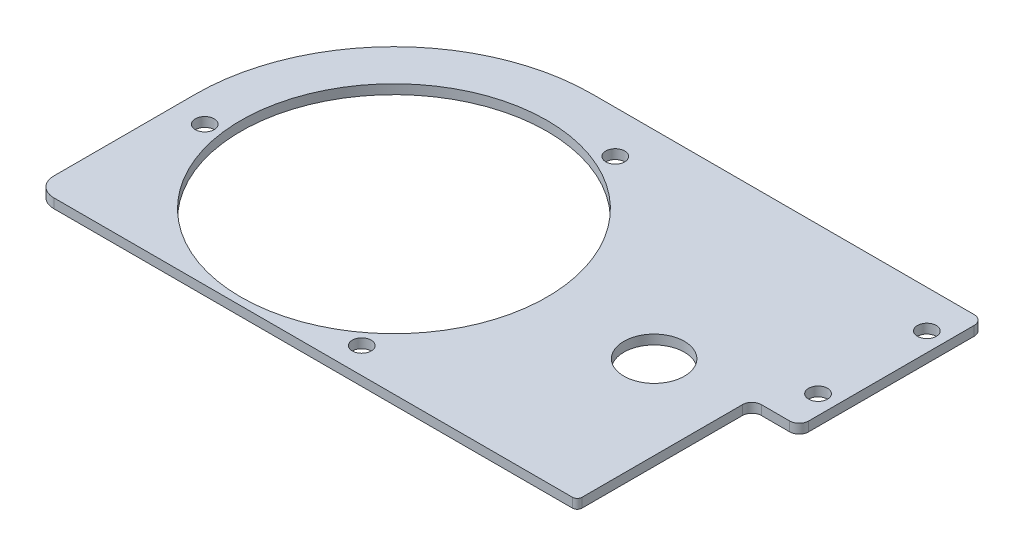
ISO-10303-21;
HEADER;
FILE_DESCRIPTION(('STEP AP214'),'2;1');
FILE_NAME('part.step','',(''),(''),'','','');
FILE_SCHEMA(('AUTOMOTIVE_DESIGN { 1 0 10303 214 1 1 1 1 }'));
ENDSEC;
DATA;
#1=APPLICATION_CONTEXT('core data for automotive mechanical design processes');
#2=APPLICATION_PROTOCOL_DEFINITION('international standard','automotive_design',2000,#1);
#3=PRODUCT_CONTEXT('',#1,'mechanical');
#4=PRODUCT('Part','Part','',(#3));
#5=PRODUCT_RELATED_PRODUCT_CATEGORY('part','',(#4));
#6=PRODUCT_DEFINITION_FORMATION('','',#4);
#7=PRODUCT_DEFINITION_CONTEXT('part definition',#1,'design');
#8=PRODUCT_DEFINITION('design','',#6,#7);
#9=PRODUCT_DEFINITION_SHAPE('','',#8);
#10=(LENGTH_UNIT() NAMED_UNIT(*) SI_UNIT(.MILLI.,.METRE.));
#11=(NAMED_UNIT(*) PLANE_ANGLE_UNIT() SI_UNIT($,.RADIAN.));
#12=(NAMED_UNIT(*) SI_UNIT($,.STERADIAN.) SOLID_ANGLE_UNIT());
#13=UNCERTAINTY_MEASURE_WITH_UNIT(LENGTH_MEASURE(1.E-05),#10,'distance_accuracy_value','');
#14=(GEOMETRIC_REPRESENTATION_CONTEXT(3) GLOBAL_UNCERTAINTY_ASSIGNED_CONTEXT((#13)) GLOBAL_UNIT_ASSIGNED_CONTEXT((#10,
#11,#12)) REPRESENTATION_CONTEXT('',''));
#15=CARTESIAN_POINT('',(0.,0.,0.));
#16=DIRECTION('',(0.,0.,1.));
#17=DIRECTION('',(1.,0.,0.));
#18=AXIS2_PLACEMENT_3D('',#15,#16,#17);
#19=CARTESIAN_POINT('',(-120.668920929197,6.35,95.2310790708027));
#20=DIRECTION('',(0.,-1.,0.));
#21=DIRECTION('',(0.,0.,-1.));
#22=AXIS2_PLACEMENT_3D('',#19,#20,#21);
#23=PLANE('',#22);
#24=CARTESIAN_POINT('',(-120.668920929197,6.35,95.2310790708027));
#25=DIRECTION('',(0.,1.,0.));
#26=DIRECTION('',(0.,0.,-1.));
#27=AXIS2_PLACEMENT_3D('',#24,#25,#26);
#28=CIRCLE('',#27,12.7);
#29=CARTESIAN_POINT('',(-133.368920929197,6.35,95.2310790708027));
#30=VERTEX_POINT('',#29);
#31=CARTESIAN_POINT('',(-120.668920929197,6.35,107.931079070803));
#32=VERTEX_POINT('',#31);
#33=EDGE_CURVE('E179',#30,#32,#28,.T.);
#34=ORIENTED_EDGE('',*,*,#33,.T.);
#35=DIRECTION('',(1.,0.,0.));
#36=VECTOR('',#35,1.);
#37=CARTESIAN_POINT('',(227.955539535401,6.35,107.931079070803));
#38=LINE('',#37,#36);
#39=CARTESIAN_POINT('',(227.955539535401,6.35,107.931079070803));
#40=VERTEX_POINT('',#39);
#41=EDGE_CURVE('E107',#32,#40,#38,.T.);
#42=ORIENTED_EDGE('',*,*,#41,.T.);
#43=CARTESIAN_POINT('',(227.955539535401,6.35,104.765539535401));
#44=DIRECTION('',(0.,1.,0.));
#45=DIRECTION('',(0.,0.,1.));
#46=AXIS2_PLACEMENT_3D('',#43,#44,#45);
#47=CIRCLE('',#46,3.16553953540139);
#48=CARTESIAN_POINT('',(231.121079070803,6.35,104.765539535401));
#49=VERTEX_POINT('',#48);
#50=EDGE_CURVE('E206',#40,#49,#47,.T.);
#51=ORIENTED_EDGE('',*,*,#50,.T.);
#52=DIRECTION('',(0.,0.,-1.));
#53=VECTOR('',#52,1.);
#54=CARTESIAN_POINT('',(231.121079070803,6.35,104.765539535401));
#55=LINE('',#54,#53);
#56=CARTESIAN_POINT('',(231.121079070803,6.35,-3.1007771089668));
#57=VERTEX_POINT('',#56);
#58=EDGE_CURVE('E225',#49,#57,#55,.T.);
#59=ORIENTED_EDGE('',*,*,#58,.T.);
#60=CARTESIAN_POINT('',(237.471079070803,6.35,-3.1007771089668));
#61=DIRECTION('',(0.,-1.,0.));
#62=DIRECTION('',(0.,0.,1.));
#63=AXIS2_PLACEMENT_3D('',#60,#61,#62);
#64=CIRCLE('',#63,6.35);
#65=CARTESIAN_POINT('',(237.471079070803,6.35,-9.4507771089668));
#66=VERTEX_POINT('',#65);
#67=EDGE_CURVE('E222',#57,#66,#64,.T.);
#68=ORIENTED_EDGE('',*,*,#67,.T.);
#69=DIRECTION('',(1.,0.,0.));
#70=VECTOR('',#69,1.);
#71=CARTESIAN_POINT('',(237.471079070803,6.35,-9.4507771089668));
#72=LINE('',#71,#70);
#73=CARTESIAN_POINT('',(256.521079070803,6.35,-9.4507771089668));
#74=VERTEX_POINT('',#73);
#75=EDGE_CURVE('E224',#66,#74,#72,.T.);
#76=ORIENTED_EDGE('',*,*,#75,.T.);
#77=CARTESIAN_POINT('',(256.521079070803,6.35,-15.8007771089668));
#78=DIRECTION('',(0.,1.,0.));
#79=DIRECTION('',(0.,0.,-1.));
#80=AXIS2_PLACEMENT_3D('',#77,#78,#79);
#81=CIRCLE('',#80,6.35000000000001);
#82=CARTESIAN_POINT('',(262.871079070803,6.35,-15.8007771089668));
#83=VERTEX_POINT('',#82);
#84=EDGE_CURVE('E227',#74,#83,#81,.T.);
#85=ORIENTED_EDGE('',*,*,#84,.T.);
#86=DIRECTION('',(0.,0.,-1.));
#87=VECTOR('',#86,1.);
#88=CARTESIAN_POINT('',(262.871079070803,6.35,-127.018920929198));
#89=LINE('',#88,#87);
#90=CARTESIAN_POINT('',(262.871079070803,6.35,-127.018920929198));
#91=VERTEX_POINT('',#90);
#92=EDGE_CURVE('E233',#83,#91,#89,.T.);
#93=ORIENTED_EDGE('',*,*,#92,.T.);
#94=CARTESIAN_POINT('',(256.521079070803,6.35,-127.018920929198));
#95=DIRECTION('',(0.,1.,0.));
#96=DIRECTION('',(0.,0.,-1.));
#97=AXIS2_PLACEMENT_3D('',#94,#95,#96);
#98=CIRCLE('',#97,6.34999999999997);
#99=CARTESIAN_POINT('',(256.521079070803,6.35,-133.368920929197));
#100=VERTEX_POINT('',#99);
#101=EDGE_CURVE('E138',#91,#100,#98,.T.);
#102=ORIENTED_EDGE('',*,*,#101,.T.);
#103=DIRECTION('',(-1.,0.,0.));
#104=VECTOR('',#103,1.);
#105=CARTESIAN_POINT('',(256.521079070803,6.35,-133.368920929197));
#106=LINE('',#105,#104);
#107=CARTESIAN_POINT('',(0.,6.35,-133.368920929197));
#108=VERTEX_POINT('',#107);
#109=EDGE_CURVE('E132',#100,#108,#106,.T.);
#110=ORIENTED_EDGE('',*,*,#109,.T.);
#111=CARTESIAN_POINT('',(0.,6.35,0.));
#112=DIRECTION('',(0.,1.,0.));
#113=DIRECTION('',(0.,0.,-1.));
#114=AXIS2_PLACEMENT_3D('',#111,#112,#113);
#115=CIRCLE('',#114,133.368920929197);
#116=CARTESIAN_POINT('',(-133.368920929197,6.35,0.));
#117=VERTEX_POINT('',#116);
#118=EDGE_CURVE('E136',#108,#117,#115,.T.);
#119=ORIENTED_EDGE('',*,*,#118,.T.);
#120=DIRECTION('',(0.,0.,1.));
#121=VECTOR('',#120,1.);
#122=CARTESIAN_POINT('',(-133.368920929197,6.35,0.));
#123=LINE('',#122,#121);
#124=EDGE_CURVE('E52',#117,#30,#123,.T.);
#125=ORIENTED_EDGE('',*,*,#124,.T.);
#126=EDGE_LOOP('',(#34,#42,#51,#59,#68,#76,#85,#93,#102,#110,#119,#125));
#127=FACE_BOUND('',#126,.T.);
#128=CARTESIAN_POINT('',(0.,6.35,0.));
#129=DIRECTION('',(0.,1.,0.));
#130=DIRECTION('',(0.,0.,1.));
#131=AXIS2_PLACEMENT_3D('',#128,#129,#130);
#132=CIRCLE('',#131,102.87);
#133=CARTESIAN_POINT('',(0.,6.35,102.87));
#134=VERTEX_POINT('',#133);
#135=EDGE_CURVE('E160',#134,#134,#132,.T.);
#136=ORIENTED_EDGE('',*,*,#135,.F.);
#137=EDGE_LOOP('',(#136));
#138=FACE_BOUND('',#137,.T.);
#139=CARTESIAN_POINT('',(-112.738641363336,6.35,14.3749635436917));
#140=DIRECTION('',(0.,1.,0.));
#141=DIRECTION('',(0.,0.,1.));
#142=AXIS2_PLACEMENT_3D('',#139,#140,#141);
#143=CIRCLE('',#142,6.34999999998765);
#144=CARTESIAN_POINT('',(-112.738641363336,6.35,20.7249635436794));
#145=VERTEX_POINT('',#144);
#146=EDGE_CURVE('E327',#145,#145,#143,.T.);
#147=ORIENTED_EDGE('',*,*,#146,.F.);
#148=EDGE_LOOP('',(#147));
#149=FACE_BOUND('',#148,.T.);
#150=CARTESIAN_POINT('',(250.171079070803,6.35,-107.968920929197));
#151=DIRECTION('',(0.,1.,0.));
#152=DIRECTION('',(0.,0.,1.));
#153=AXIS2_PLACEMENT_3D('',#150,#151,#152);
#154=CIRCLE('',#153,6.34999999999999);
#155=CARTESIAN_POINT('',(250.171079070803,6.35,-101.618920929198));
#156=VERTEX_POINT('',#155);
#157=EDGE_CURVE('E321',#156,#156,#154,.T.);
#158=ORIENTED_EDGE('',*,*,#157,.F.);
#159=EDGE_LOOP('',(#158));
#160=FACE_BOUND('',#159,.T.);
#161=CARTESIAN_POINT('',(250.171079070803,6.35,-34.8507771089668));
#162=DIRECTION('',(0.,1.,0.));
#163=DIRECTION('',(0.,0.,1.));
#164=AXIS2_PLACEMENT_3D('',#161,#162,#163);
#165=CIRCLE('',#164,6.34999999999993);
#166=CARTESIAN_POINT('',(250.171079070803,6.35,-28.5007771089669));
#167=VERTEX_POINT('',#166);
#168=EDGE_CURVE('E315',#167,#167,#165,.T.);
#169=ORIENTED_EDGE('',*,*,#168,.F.);
#170=EDGE_LOOP('',(#169));
#171=FACE_BOUND('',#170,.T.);
#172=CARTESIAN_POINT('',(43.9202370743556,6.35,-104.822009180638));
#173=DIRECTION('',(0.,1.,0.));
#174=DIRECTION('',(0.,0.,1.));
#175=AXIS2_PLACEMENT_3D('',#172,#173,#174);
#176=CIRCLE('',#175,6.35000000000716);
#177=CARTESIAN_POINT('',(43.9202370743556,6.35,-98.4720091806305));
#178=VERTEX_POINT('',#177);
#179=EDGE_CURVE('E309',#178,#178,#176,.T.);
#180=ORIENTED_EDGE('',*,*,#179,.F.);
#181=EDGE_LOOP('',(#180));
#182=FACE_BOUND('',#181,.T.);
#183=CARTESIAN_POINT('',(68.8184042889801,6.35,90.4470456369459));
#184=DIRECTION('',(0.,1.,0.));
#185=DIRECTION('',(0.,0.,1.));
#186=AXIS2_PLACEMENT_3D('',#183,#184,#185);
#187=CIRCLE('',#186,6.35000000000515);
#188=CARTESIAN_POINT('',(68.8184042889801,6.35,96.7970456369511));
#189=VERTEX_POINT('',#188);
#190=EDGE_CURVE('E302',#189,#189,#187,.T.);
#191=ORIENTED_EDGE('',*,*,#190,.F.);
#192=EDGE_LOOP('',(#191));
#193=FACE_BOUND('',#192,.T.);
#194=CARTESIAN_POINT('',(174.732998702395,6.35,-0.124686488838717));
#195=DIRECTION('',(0.,-1.,0.));
#196=DIRECTION('',(0.,0.,-1.));
#197=AXIS2_PLACEMENT_3D('',#194,#195,#196);
#198=CIRCLE('',#197,20.32);
#199=CARTESIAN_POINT('',(174.732998702395,6.35,-20.4446864888387));
#200=VERTEX_POINT('',#199);
#201=EDGE_CURVE('E297',#200,#200,#198,.F.);
#202=ORIENTED_EDGE('',*,*,#201,.F.);
#203=EDGE_LOOP('',(#202));
#204=FACE_BOUND('',#203,.T.);
#205=ADVANCED_FACE('F35',(#127,#138,#149,#160,#171,#182,#193,#204),#23,.F.);
#206=CARTESIAN_POINT('',(-120.668920929197,0.,95.2310790708027));
#207=DIRECTION('',(0.,-1.,0.));
#208=DIRECTION('',(0.,0.,-1.));
#209=AXIS2_PLACEMENT_3D('',#206,#207,#208);
#210=PLANE('',#209);
#211=CARTESIAN_POINT('',(68.8184042889801,0.,90.4470456369459));
#212=DIRECTION('',(0.,1.,0.));
#213=DIRECTION('',(0.,0.,1.));
#214=AXIS2_PLACEMENT_3D('',#211,#212,#213);
#215=CIRCLE('',#214,6.35000000000515);
#216=CARTESIAN_POINT('',(68.8184042889801,0.,96.7970456369511));
#217=VERTEX_POINT('',#216);
#218=EDGE_CURVE('E299',#217,#217,#215,.T.);
#219=ORIENTED_EDGE('',*,*,#218,.T.);
#220=EDGE_LOOP('',(#219));
#221=FACE_BOUND('',#220,.T.);
#222=CARTESIAN_POINT('',(250.171079070803,0.,-34.8507771089668));
#223=DIRECTION('',(0.,1.,0.));
#224=DIRECTION('',(0.,0.,1.));
#225=AXIS2_PLACEMENT_3D('',#222,#223,#224);
#226=CIRCLE('',#225,6.34999999999993);
#227=CARTESIAN_POINT('',(250.171079070803,0.,-28.5007771089669));
#228=VERTEX_POINT('',#227);
#229=EDGE_CURVE('E312',#228,#228,#226,.T.);
#230=ORIENTED_EDGE('',*,*,#229,.T.);
#231=EDGE_LOOP('',(#230));
#232=FACE_BOUND('',#231,.T.);
#233=CARTESIAN_POINT('',(-112.738641363336,0.,14.3749635436917));
#234=DIRECTION('',(0.,1.,0.));
#235=DIRECTION('',(0.,0.,1.));
#236=AXIS2_PLACEMENT_3D('',#233,#234,#235);
#237=CIRCLE('',#236,6.34999999998765);
#238=CARTESIAN_POINT('',(-112.738641363336,0.,20.7249635436794));
#239=VERTEX_POINT('',#238);
#240=EDGE_CURVE('E324',#239,#239,#237,.T.);
#241=ORIENTED_EDGE('',*,*,#240,.T.);
#242=EDGE_LOOP('',(#241));
#243=FACE_BOUND('',#242,.T.);
#244=CARTESIAN_POINT('',(-120.668920929197,0.,95.2310790708027));
#245=DIRECTION('',(0.,1.,0.));
#246=DIRECTION('',(0.,0.,-1.));
#247=AXIS2_PLACEMENT_3D('',#244,#245,#246);
#248=CIRCLE('',#247,12.7);
#249=CARTESIAN_POINT('',(-133.368920929197,0.,95.2310790708027));
#250=VERTEX_POINT('',#249);
#251=CARTESIAN_POINT('',(-120.668920929197,0.,107.931079070803));
#252=VERTEX_POINT('',#251);
#253=EDGE_CURVE('E156',#250,#252,#248,.T.);
#254=ORIENTED_EDGE('',*,*,#253,.F.);
#255=DIRECTION('',(0.,0.,1.));
#256=VECTOR('',#255,1.);
#257=CARTESIAN_POINT('',(-133.368920929197,0.,0.));
#258=LINE('',#257,#256);
#259=CARTESIAN_POINT('',(-133.368920929197,0.,0.));
#260=VERTEX_POINT('',#259);
#261=EDGE_CURVE('E99',#260,#250,#258,.T.);
#262=ORIENTED_EDGE('',*,*,#261,.F.);
#263=CARTESIAN_POINT('',(0.,0.,0.));
#264=DIRECTION('',(0.,1.,0.));
#265=DIRECTION('',(0.,0.,-1.));
#266=AXIS2_PLACEMENT_3D('',#263,#264,#265);
#267=CIRCLE('',#266,133.368920929197);
#268=CARTESIAN_POINT('',(0.,0.,-133.368920929197));
#269=VERTEX_POINT('',#268);
#270=EDGE_CURVE('E93',#269,#260,#267,.T.);
#271=ORIENTED_EDGE('',*,*,#270,.F.);
#272=DIRECTION('',(-1.,0.,0.));
#273=VECTOR('',#272,1.);
#274=CARTESIAN_POINT('',(256.521079070803,0.,-133.368920929197));
#275=LINE('',#274,#273);
#276=CARTESIAN_POINT('',(256.521079070803,0.,-133.368920929197));
#277=VERTEX_POINT('',#276);
#278=EDGE_CURVE('E146',#277,#269,#275,.T.);
#279=ORIENTED_EDGE('',*,*,#278,.F.);
#280=CARTESIAN_POINT('',(256.521079070803,0.,-127.018920929198));
#281=DIRECTION('',(0.,1.,0.));
#282=DIRECTION('',(0.,0.,-1.));
#283=AXIS2_PLACEMENT_3D('',#280,#281,#282);
#284=CIRCLE('',#283,6.34999999999997);
#285=CARTESIAN_POINT('',(262.871079070803,0.,-127.018920929198));
#286=VERTEX_POINT('',#285);
#287=EDGE_CURVE('E174',#286,#277,#284,.T.);
#288=ORIENTED_EDGE('',*,*,#287,.F.);
#289=DIRECTION('',(0.,0.,-1.));
#290=VECTOR('',#289,1.);
#291=CARTESIAN_POINT('',(262.871079070803,0.,-127.018920929198));
#292=LINE('',#291,#290);
#293=CARTESIAN_POINT('',(262.871079070803,0.,-15.8007771089668));
#294=VERTEX_POINT('',#293);
#295=EDGE_CURVE('E172',#294,#286,#292,.T.);
#296=ORIENTED_EDGE('',*,*,#295,.F.);
#297=CARTESIAN_POINT('',(256.521079070803,0.,-15.8007771089668));
#298=DIRECTION('',(0.,1.,0.));
#299=DIRECTION('',(0.,0.,-1.));
#300=AXIS2_PLACEMENT_3D('',#297,#298,#299);
#301=CIRCLE('',#300,6.35000000000001);
#302=CARTESIAN_POINT('',(256.521079070803,0.,-9.4507771089668));
#303=VERTEX_POINT('',#302);
#304=EDGE_CURVE('E170',#303,#294,#301,.T.);
#305=ORIENTED_EDGE('',*,*,#304,.F.);
#306=DIRECTION('',(1.,0.,0.));
#307=VECTOR('',#306,1.);
#308=CARTESIAN_POINT('',(237.471079070803,0.,-9.4507771089668));
#309=LINE('',#308,#307);
#310=CARTESIAN_POINT('',(237.471079070803,0.,-9.4507771089668));
#311=VERTEX_POINT('',#310);
#312=EDGE_CURVE('E168',#311,#303,#309,.T.);
#313=ORIENTED_EDGE('',*,*,#312,.F.);
#314=CARTESIAN_POINT('',(237.471079070803,0.,-3.1007771089668));
#315=DIRECTION('',(0.,-1.,0.));
#316=DIRECTION('',(0.,0.,1.));
#317=AXIS2_PLACEMENT_3D('',#314,#315,#316);
#318=CIRCLE('',#317,6.35);
#319=CARTESIAN_POINT('',(231.121079070803,0.,-3.1007771089668));
#320=VERTEX_POINT('',#319);
#321=EDGE_CURVE('E166',#320,#311,#318,.T.);
#322=ORIENTED_EDGE('',*,*,#321,.F.);
#323=DIRECTION('',(0.,0.,-1.));
#324=VECTOR('',#323,1.);
#325=CARTESIAN_POINT('',(231.121079070803,0.,104.765539535401));
#326=LINE('',#325,#324);
#327=CARTESIAN_POINT('',(231.121079070803,0.,104.765539535401));
#328=VERTEX_POINT('',#327);
#329=EDGE_CURVE('E164',#328,#320,#326,.T.);
#330=ORIENTED_EDGE('',*,*,#329,.F.);
#331=CARTESIAN_POINT('',(227.955539535401,0.,104.765539535401));
#332=DIRECTION('',(0.,1.,0.));
#333=DIRECTION('',(0.,0.,1.));
#334=AXIS2_PLACEMENT_3D('',#331,#332,#333);
#335=CIRCLE('',#334,3.16553953540139);
#336=CARTESIAN_POINT('',(227.955539535401,0.,107.931079070803));
#337=VERTEX_POINT('',#336);
#338=EDGE_CURVE('E162',#337,#328,#335,.T.);
#339=ORIENTED_EDGE('',*,*,#338,.F.);
#340=DIRECTION('',(1.,0.,0.));
#341=VECTOR('',#340,1.);
#342=CARTESIAN_POINT('',(227.955539535401,0.,107.931079070803));
#343=LINE('',#342,#341);
#344=EDGE_CURVE('E159',#252,#337,#343,.T.);
#345=ORIENTED_EDGE('',*,*,#344,.F.);
#346=EDGE_LOOP('',(#254,#262,#271,#279,#288,#296,#305,#313,#322,#330,#339,#345));
#347=FACE_BOUND('',#346,.T.);
#348=CARTESIAN_POINT('',(0.,0.,0.));
#349=DIRECTION('',(0.,1.,0.));
#350=DIRECTION('',(0.,0.,1.));
#351=AXIS2_PLACEMENT_3D('',#348,#349,#350);
#352=CIRCLE('',#351,102.87);
#353=CARTESIAN_POINT('',(0.,0.,102.87));
#354=VERTEX_POINT('',#353);
#355=EDGE_CURVE('E330',#354,#354,#352,.T.);
#356=ORIENTED_EDGE('',*,*,#355,.T.);
#357=EDGE_LOOP('',(#356));
#358=FACE_BOUND('',#357,.T.);
#359=CARTESIAN_POINT('',(250.171079070803,0.,-107.968920929197));
#360=DIRECTION('',(0.,1.,0.));
#361=DIRECTION('',(0.,0.,1.));
#362=AXIS2_PLACEMENT_3D('',#359,#360,#361);
#363=CIRCLE('',#362,6.34999999999999);
#364=CARTESIAN_POINT('',(250.171079070803,0.,-101.618920929198));
#365=VERTEX_POINT('',#364);
#366=EDGE_CURVE('E318',#365,#365,#363,.T.);
#367=ORIENTED_EDGE('',*,*,#366,.T.);
#368=EDGE_LOOP('',(#367));
#369=FACE_BOUND('',#368,.T.);
#370=CARTESIAN_POINT('',(43.9202370743556,0.,-104.822009180638));
#371=DIRECTION('',(0.,1.,0.));
#372=DIRECTION('',(0.,0.,1.));
#373=AXIS2_PLACEMENT_3D('',#370,#371,#372);
#374=CIRCLE('',#373,6.35000000000716);
#375=CARTESIAN_POINT('',(43.9202370743556,0.,-98.4720091806305));
#376=VERTEX_POINT('',#375);
#377=EDGE_CURVE('E307',#376,#376,#374,.T.);
#378=ORIENTED_EDGE('',*,*,#377,.T.);
#379=EDGE_LOOP('',(#378));
#380=FACE_BOUND('',#379,.T.);
#381=CARTESIAN_POINT('',(174.732998702395,0.,-0.124686488838717));
#382=DIRECTION('',(0.,1.,0.));
#383=DIRECTION('',(0.,0.,1.));
#384=AXIS2_PLACEMENT_3D('',#381,#382,#383);
#385=CIRCLE('',#384,20.32);
#386=CARTESIAN_POINT('',(174.732998702395,0.,20.1953135111613));
#387=VERTEX_POINT('',#386);
#388=EDGE_CURVE('E294',#387,#387,#385,.T.);
#389=ORIENTED_EDGE('',*,*,#388,.T.);
#390=EDGE_LOOP('',(#389));
#391=FACE_BOUND('',#390,.T.);
#392=ADVANCED_FACE('F210',(#221,#232,#243,#347,#358,#369,#380,#391),#210,.T.);
#393=CARTESIAN_POINT('',(-120.668920929197,6.35,95.2310790708027));
#394=DIRECTION('',(0.,-1.,0.));
#395=DIRECTION('',(0.,0.,-1.));
#396=AXIS2_PLACEMENT_3D('',#393,#394,#395);
#397=CYLINDRICAL_SURFACE('',#396,12.7);
#398=ORIENTED_EDGE('',*,*,#253,.T.);
#399=DIRECTION('',(0.,-1.,0.));
#400=VECTOR('',#399,1.);
#401=CARTESIAN_POINT('',(-120.668920929197,6.35,107.931079070803));
#402=LINE('',#401,#400);
#403=EDGE_CURVE('E11',#32,#252,#402,.T.);
#404=ORIENTED_EDGE('',*,*,#403,.F.);
#405=ORIENTED_EDGE('',*,*,#33,.F.);
#406=DIRECTION('',(0.,-1.,0.));
#407=VECTOR('',#406,1.);
#408=CARTESIAN_POINT('',(-133.368920929197,6.35,95.2310790708027));
#409=LINE('',#408,#407);
#410=EDGE_CURVE('E152',#30,#250,#409,.T.);
#411=ORIENTED_EDGE('',*,*,#410,.T.);
#412=EDGE_LOOP('',(#398,#404,#405,#411));
#413=FACE_BOUND('',#412,.T.);
#414=ADVANCED_FACE('F37',(#413),#397,.T.);
#415=CARTESIAN_POINT('',(227.955539535401,6.35,107.931079070803));
#416=DIRECTION('',(0.,0.,-1.));
#417=DIRECTION('',(-1.,0.,0.));
#418=AXIS2_PLACEMENT_3D('',#415,#416,#417);
#419=PLANE('',#418);
#420=ORIENTED_EDGE('',*,*,#344,.T.);
#421=DIRECTION('',(0.,-1.,0.));
#422=VECTOR('',#421,1.);
#423=CARTESIAN_POINT('',(227.955539535401,6.35,107.931079070803));
#424=LINE('',#423,#422);
#425=EDGE_CURVE('E44',#40,#337,#424,.T.);
#426=ORIENTED_EDGE('',*,*,#425,.F.);
#427=ORIENTED_EDGE('',*,*,#41,.F.);
#428=ORIENTED_EDGE('',*,*,#403,.T.);
#429=EDGE_LOOP('',(#420,#426,#427,#428));
#430=FACE_BOUND('',#429,.T.);
#431=ADVANCED_FACE('F471',(#430),#419,.F.);
#432=CARTESIAN_POINT('',(227.955539535401,6.35,104.765539535401));
#433=DIRECTION('',(0.,-1.,0.));
#434=DIRECTION('',(0.,0.,-1.));
#435=AXIS2_PLACEMENT_3D('',#432,#433,#434);
#436=CYLINDRICAL_SURFACE('',#435,3.16553953540139);
#437=ORIENTED_EDGE('',*,*,#338,.T.);
#438=DIRECTION('',(0.,-1.,0.));
#439=VECTOR('',#438,1.);
#440=CARTESIAN_POINT('',(231.121079070803,6.35,104.765539535401));
#441=LINE('',#440,#439);
#442=EDGE_CURVE('E198',#49,#328,#441,.T.);
#443=ORIENTED_EDGE('',*,*,#442,.F.);
#444=ORIENTED_EDGE('',*,*,#50,.F.);
#445=ORIENTED_EDGE('',*,*,#425,.T.);
#446=EDGE_LOOP('',(#437,#443,#444,#445));
#447=FACE_BOUND('',#446,.T.);
#448=ADVANCED_FACE('F204',(#447),#436,.T.);
#449=CARTESIAN_POINT('',(231.121079070803,6.35,104.765539535401));
#450=DIRECTION('',(-1.,0.,0.));
#451=DIRECTION('',(0.,0.,1.));
#452=AXIS2_PLACEMENT_3D('',#449,#450,#451);
#453=PLANE('',#452);
#454=ORIENTED_EDGE('',*,*,#329,.T.);
#455=DIRECTION('',(0.,-1.,0.));
#456=VECTOR('',#455,1.);
#457=CARTESIAN_POINT('',(231.121079070803,6.35,-3.1007771089668));
#458=LINE('',#457,#456);
#459=EDGE_CURVE('E195',#57,#320,#458,.T.);
#460=ORIENTED_EDGE('',*,*,#459,.F.);
#461=ORIENTED_EDGE('',*,*,#58,.F.);
#462=ORIENTED_EDGE('',*,*,#442,.T.);
#463=EDGE_LOOP('',(#454,#460,#461,#462));
#464=FACE_BOUND('',#463,.T.);
#465=ADVANCED_FACE('F216',(#464),#453,.F.);
#466=CARTESIAN_POINT('',(237.471079070803,6.35,-3.1007771089668));
#467=DIRECTION('',(0.,-1.,0.));
#468=DIRECTION('',(0.,0.,-1.));
#469=AXIS2_PLACEMENT_3D('',#466,#467,#468);
#470=CYLINDRICAL_SURFACE('',#469,6.35);
#471=ORIENTED_EDGE('',*,*,#321,.T.);
#472=DIRECTION('',(0.,-1.,0.));
#473=VECTOR('',#472,1.);
#474=CARTESIAN_POINT('',(237.471079070803,6.35,-9.4507771089668));
#475=LINE('',#474,#473);
#476=EDGE_CURVE('E192',#66,#311,#475,.T.);
#477=ORIENTED_EDGE('',*,*,#476,.F.);
#478=ORIENTED_EDGE('',*,*,#67,.F.);
#479=ORIENTED_EDGE('',*,*,#459,.T.);
#480=EDGE_LOOP('',(#471,#477,#478,#479));
#481=FACE_BOUND('',#480,.T.);
#482=ADVANCED_FACE('F220',(#481),#470,.F.);
#483=CARTESIAN_POINT('',(237.471079070803,6.35,-9.4507771089668));
#484=DIRECTION('',(0.,0.,-1.));
#485=DIRECTION('',(-1.,0.,0.));
#486=AXIS2_PLACEMENT_3D('',#483,#484,#485);
#487=PLANE('',#486);
#488=ORIENTED_EDGE('',*,*,#312,.T.);
#489=DIRECTION('',(0.,-1.,0.));
#490=VECTOR('',#489,1.);
#491=CARTESIAN_POINT('',(256.521079070803,6.35,-9.4507771089668));
#492=LINE('',#491,#490);
#493=EDGE_CURVE('E189',#74,#303,#492,.T.);
#494=ORIENTED_EDGE('',*,*,#493,.F.);
#495=ORIENTED_EDGE('',*,*,#75,.F.);
#496=ORIENTED_EDGE('',*,*,#476,.T.);
#497=EDGE_LOOP('',(#488,#494,#495,#496));
#498=FACE_BOUND('',#497,.T.);
#499=ADVANCED_FACE('F436',(#498),#487,.F.);
#500=CARTESIAN_POINT('',(256.521079070803,6.35,-15.8007771089668));
#501=DIRECTION('',(0.,-1.,0.));
#502=DIRECTION('',(0.,0.,-1.));
#503=AXIS2_PLACEMENT_3D('',#500,#501,#502);
#504=CYLINDRICAL_SURFACE('',#503,6.35000000000001);
#505=ORIENTED_EDGE('',*,*,#304,.T.);
#506=DIRECTION('',(0.,-1.,0.));
#507=VECTOR('',#506,1.);
#508=CARTESIAN_POINT('',(262.871079070803,6.35,-15.8007771089668));
#509=LINE('',#508,#507);
#510=EDGE_CURVE('E186',#83,#294,#509,.T.);
#511=ORIENTED_EDGE('',*,*,#510,.F.);
#512=ORIENTED_EDGE('',*,*,#84,.F.);
#513=ORIENTED_EDGE('',*,*,#493,.T.);
#514=EDGE_LOOP('',(#505,#511,#512,#513));
#515=FACE_BOUND('',#514,.T.);
#516=ADVANCED_FACE('F427',(#515),#504,.T.);
#517=CARTESIAN_POINT('',(262.871079070803,6.35,-127.018920929198));
#518=DIRECTION('',(-1.,0.,0.));
#519=DIRECTION('',(0.,0.,1.));
#520=AXIS2_PLACEMENT_3D('',#517,#518,#519);
#521=PLANE('',#520);
#522=ORIENTED_EDGE('',*,*,#295,.T.);
#523=DIRECTION('',(0.,-1.,0.));
#524=VECTOR('',#523,1.);
#525=CARTESIAN_POINT('',(262.871079070803,6.35,-127.018920929198));
#526=LINE('',#525,#524);
#527=EDGE_CURVE('E183',#91,#286,#526,.T.);
#528=ORIENTED_EDGE('',*,*,#527,.F.);
#529=ORIENTED_EDGE('',*,*,#92,.F.);
#530=ORIENTED_EDGE('',*,*,#510,.T.);
#531=EDGE_LOOP('',(#522,#528,#529,#530));
#532=FACE_BOUND('',#531,.T.);
#533=ADVANCED_FACE('F239',(#532),#521,.F.);
#534=CARTESIAN_POINT('',(256.521079070803,6.35,-127.018920929198));
#535=DIRECTION('',(0.,-1.,0.));
#536=DIRECTION('',(0.,0.,-1.));
#537=AXIS2_PLACEMENT_3D('',#534,#535,#536);
#538=CYLINDRICAL_SURFACE('',#537,6.34999999999997);
#539=ORIENTED_EDGE('',*,*,#287,.T.);
#540=DIRECTION('',(0.,-1.,0.));
#541=VECTOR('',#540,1.);
#542=CARTESIAN_POINT('',(256.521079070803,6.35,-133.368920929197));
#543=LINE('',#542,#541);
#544=EDGE_CURVE('E147',#100,#277,#543,.T.);
#545=ORIENTED_EDGE('',*,*,#544,.F.);
#546=ORIENTED_EDGE('',*,*,#101,.F.);
#547=ORIENTED_EDGE('',*,*,#527,.T.);
#548=EDGE_LOOP('',(#539,#545,#546,#547));
#549=FACE_BOUND('',#548,.T.);
#550=ADVANCED_FACE('F243',(#549),#538,.T.);
#551=CARTESIAN_POINT('',(256.521079070803,6.35,-133.368920929197));
#552=DIRECTION('',(0.,0.,1.));
#553=DIRECTION('',(1.,0.,0.));
#554=AXIS2_PLACEMENT_3D('',#551,#552,#553);
#555=PLANE('',#554);
#556=ORIENTED_EDGE('',*,*,#278,.T.);
#557=DIRECTION('',(0.,-1.,0.));
#558=VECTOR('',#557,1.);
#559=CARTESIAN_POINT('',(0.,6.35,-133.368920929197));
#560=LINE('',#559,#558);
#561=EDGE_CURVE('E143',#108,#269,#560,.T.);
#562=ORIENTED_EDGE('',*,*,#561,.F.);
#563=ORIENTED_EDGE('',*,*,#109,.F.);
#564=ORIENTED_EDGE('',*,*,#544,.T.);
#565=EDGE_LOOP('',(#556,#562,#563,#564));
#566=FACE_BOUND('',#565,.T.);
#567=ADVANCED_FACE('F144',(#566),#555,.F.);
#568=CARTESIAN_POINT('',(0.,6.35,0.));
#569=DIRECTION('',(0.,-1.,0.));
#570=DIRECTION('',(0.,0.,-1.));
#571=AXIS2_PLACEMENT_3D('',#568,#569,#570);
#572=CYLINDRICAL_SURFACE('',#571,133.368920929197);
#573=ORIENTED_EDGE('',*,*,#270,.T.);
#574=DIRECTION('',(0.,-1.,0.));
#575=VECTOR('',#574,1.);
#576=CARTESIAN_POINT('',(-133.368920929197,6.35,0.));
#577=LINE('',#576,#575);
#578=EDGE_CURVE('E148',#117,#260,#577,.T.);
#579=ORIENTED_EDGE('',*,*,#578,.F.);
#580=ORIENTED_EDGE('',*,*,#118,.F.);
#581=ORIENTED_EDGE('',*,*,#561,.T.);
#582=EDGE_LOOP('',(#573,#579,#580,#581));
#583=FACE_BOUND('',#582,.T.);
#584=ADVANCED_FACE('F150',(#583),#572,.T.);
#585=CARTESIAN_POINT('',(-133.368920929197,6.35,0.));
#586=DIRECTION('',(1.,0.,0.));
#587=DIRECTION('',(0.,0.,-1.));
#588=AXIS2_PLACEMENT_3D('',#585,#586,#587);
#589=PLANE('',#588);
#590=ORIENTED_EDGE('',*,*,#261,.T.);
#591=ORIENTED_EDGE('',*,*,#410,.F.);
#592=ORIENTED_EDGE('',*,*,#124,.F.);
#593=ORIENTED_EDGE('',*,*,#578,.T.);
#594=EDGE_LOOP('',(#590,#591,#592,#593));
#595=FACE_BOUND('',#594,.T.);
#596=ADVANCED_FACE('F247',(#595),#589,.F.);
#597=CARTESIAN_POINT('',(0.,6.35,0.));
#598=DIRECTION('',(0.,-1.,0.));
#599=DIRECTION('',(0.,0.,-1.));
#600=AXIS2_PLACEMENT_3D('',#597,#598,#599);
#601=CYLINDRICAL_SURFACE('',#600,102.87);
#602=ORIENTED_EDGE('',*,*,#135,.T.);
#603=EDGE_LOOP('',(#602));
#604=FACE_BOUND('',#603,.T.);
#605=ORIENTED_EDGE('',*,*,#355,.F.);
#606=EDGE_LOOP('',(#605));
#607=FACE_BOUND('',#606,.T.);
#608=ADVANCED_FACE('F249',(#604,#607),#601,.F.);
#609=CARTESIAN_POINT('',(-112.738641363336,6.35,14.3749635436917));
#610=DIRECTION('',(0.,-1.,0.));
#611=DIRECTION('',(0.,0.,-1.));
#612=AXIS2_PLACEMENT_3D('',#609,#610,#611);
#613=CYLINDRICAL_SURFACE('',#612,6.34999999998765);
#614=ORIENTED_EDGE('',*,*,#146,.T.);
#615=EDGE_LOOP('',(#614));
#616=FACE_BOUND('',#615,.T.);
#617=ORIENTED_EDGE('',*,*,#240,.F.);
#618=EDGE_LOOP('',(#617));
#619=FACE_BOUND('',#618,.T.);
#620=ADVANCED_FACE('F255',(#616,#619),#613,.F.);
#621=CARTESIAN_POINT('',(250.171079070803,6.35,-107.968920929197));
#622=DIRECTION('',(0.,-1.,0.));
#623=DIRECTION('',(0.,0.,-1.));
#624=AXIS2_PLACEMENT_3D('',#621,#622,#623);
#625=CYLINDRICAL_SURFACE('',#624,6.34999999999999);
#626=ORIENTED_EDGE('',*,*,#157,.T.);
#627=EDGE_LOOP('',(#626));
#628=FACE_BOUND('',#627,.T.);
#629=ORIENTED_EDGE('',*,*,#366,.F.);
#630=EDGE_LOOP('',(#629));
#631=FACE_BOUND('',#630,.T.);
#632=ADVANCED_FACE('F269',(#628,#631),#625,.F.);
#633=CARTESIAN_POINT('',(250.171079070803,6.35,-34.8507771089668));
#634=DIRECTION('',(0.,-1.,0.));
#635=DIRECTION('',(0.,0.,-1.));
#636=AXIS2_PLACEMENT_3D('',#633,#634,#635);
#637=CYLINDRICAL_SURFACE('',#636,6.34999999999993);
#638=ORIENTED_EDGE('',*,*,#168,.T.);
#639=EDGE_LOOP('',(#638));
#640=FACE_BOUND('',#639,.T.);
#641=ORIENTED_EDGE('',*,*,#229,.F.);
#642=EDGE_LOOP('',(#641));
#643=FACE_BOUND('',#642,.T.);
#644=ADVANCED_FACE('F273',(#640,#643),#637,.F.);
#645=CARTESIAN_POINT('',(43.9202370743556,6.35,-104.822009180638));
#646=DIRECTION('',(0.,-1.,0.));
#647=DIRECTION('',(0.,0.,-1.));
#648=AXIS2_PLACEMENT_3D('',#645,#646,#647);
#649=CYLINDRICAL_SURFACE('',#648,6.35000000000716);
#650=ORIENTED_EDGE('',*,*,#179,.T.);
#651=EDGE_LOOP('',(#650));
#652=FACE_BOUND('',#651,.T.);
#653=ORIENTED_EDGE('',*,*,#377,.F.);
#654=EDGE_LOOP('',(#653));
#655=FACE_BOUND('',#654,.T.);
#656=ADVANCED_FACE('F277',(#652,#655),#649,.F.);
#657=CARTESIAN_POINT('',(68.8184042889801,6.35,90.4470456369459));
#658=DIRECTION('',(0.,-1.,0.));
#659=DIRECTION('',(0.,0.,-1.));
#660=AXIS2_PLACEMENT_3D('',#657,#658,#659);
#661=CYLINDRICAL_SURFACE('',#660,6.35000000000515);
#662=ORIENTED_EDGE('',*,*,#190,.T.);
#663=EDGE_LOOP('',(#662));
#664=FACE_BOUND('',#663,.T.);
#665=ORIENTED_EDGE('',*,*,#218,.F.);
#666=EDGE_LOOP('',(#665));
#667=FACE_BOUND('',#666,.T.);
#668=ADVANCED_FACE('F281',(#664,#667),#661,.F.);
#669=CARTESIAN_POINT('',(174.732998702395,28.448,-0.124686488838717));
#670=DIRECTION('',(0.,-1.,0.));
#671=DIRECTION('',(0.,0.,-1.));
#672=AXIS2_PLACEMENT_3D('',#669,#670,#671);
#673=CYLINDRICAL_SURFACE('',#672,20.32);
#674=ORIENTED_EDGE('',*,*,#388,.F.);
#675=EDGE_LOOP('',(#674));
#676=FACE_BOUND('',#675,.T.);
#677=ORIENTED_EDGE('',*,*,#201,.T.);
#678=EDGE_LOOP('',(#677));
#679=FACE_BOUND('',#678,.T.);
#680=ADVANCED_FACE('F285',(#676,#679),#673,.F.);
#681=CLOSED_SHELL('',(#205,#392,#414,#431,#448,#465,#482,#499,#516,#533,#550,#567,#584,#596,
#608,#620,#632,#644,#656,#668,#680));
#682=MANIFOLD_SOLID_BREP('B2',#681);
#683=ADVANCED_BREP_SHAPE_REPRESENTATION('',(#18,#682),#14);
#684=SHAPE_DEFINITION_REPRESENTATION(#9,#683);
ENDSEC;
END-ISO-10303-21;
